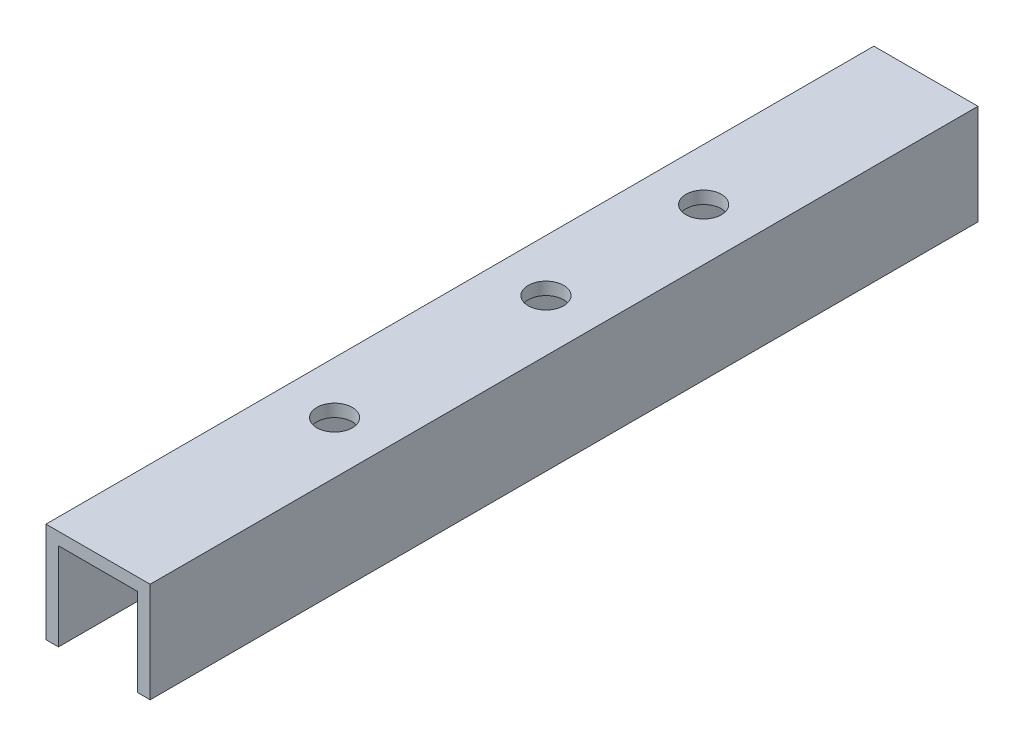
ISO-10303-21;
HEADER;
FILE_DESCRIPTION(('STEP AP214'),'2;1');
FILE_NAME('part.step','',(''),(''),'','','');
FILE_SCHEMA(('AUTOMOTIVE_DESIGN { 1 0 10303 214 1 1 1 1 }'));
ENDSEC;
DATA;
#1=APPLICATION_CONTEXT('core data for automotive mechanical design processes');
#2=APPLICATION_PROTOCOL_DEFINITION('international standard','automotive_design',2000,#1);
#3=PRODUCT_CONTEXT('',#1,'mechanical');
#4=PRODUCT('Part','Part','',(#3));
#5=PRODUCT_RELATED_PRODUCT_CATEGORY('part','',(#4));
#6=PRODUCT_DEFINITION_FORMATION('','',#4);
#7=PRODUCT_DEFINITION_CONTEXT('part definition',#1,'design');
#8=PRODUCT_DEFINITION('design','',#6,#7);
#9=PRODUCT_DEFINITION_SHAPE('','',#8);
#10=(LENGTH_UNIT() NAMED_UNIT(*) SI_UNIT(.MILLI.,.METRE.));
#11=(NAMED_UNIT(*) PLANE_ANGLE_UNIT() SI_UNIT($,.RADIAN.));
#12=(NAMED_UNIT(*) SI_UNIT($,.STERADIAN.) SOLID_ANGLE_UNIT());
#13=UNCERTAINTY_MEASURE_WITH_UNIT(LENGTH_MEASURE(1.E-05),#10,'distance_accuracy_value','');
#14=(GEOMETRIC_REPRESENTATION_CONTEXT(3) GLOBAL_UNCERTAINTY_ASSIGNED_CONTEXT((#13)) GLOBAL_UNIT_ASSIGNED_CONTEXT((#10,
#11,#12)) REPRESENTATION_CONTEXT('',''));
#15=CARTESIAN_POINT('',(0.,0.,0.));
#16=DIRECTION('',(0.,0.,1.));
#17=DIRECTION('',(1.,0.,0.));
#18=AXIS2_PLACEMENT_3D('',#15,#16,#17);
#19=CARTESIAN_POINT('',(-6.604,0.,-105.));
#20=DIRECTION('',(-1.,0.,0.));
#21=DIRECTION('',(0.,-1.,0.));
#22=AXIS2_PLACEMENT_3D('',#19,#20,#21);
#23=PLANE('',#22);
#24=DIRECTION('',(0.,-1.,0.));
#25=VECTOR('',#24,1.);
#26=CARTESIAN_POINT('',(-6.604,0.,0.));
#27=LINE('',#26,#25);
#28=CARTESIAN_POINT('',(-6.604,0.,0.));
#29=VERTEX_POINT('',#28);
#30=CARTESIAN_POINT('',(-6.604,-12.7,0.));
#31=VERTEX_POINT('',#30);
#32=EDGE_CURVE('E137',#29,#31,#27,.T.);
#33=ORIENTED_EDGE('',*,*,#32,.F.);
#34=DIRECTION('',(0.,0.,1.));
#35=VECTOR('',#34,1.);
#36=CARTESIAN_POINT('',(-6.604,0.,-105.));
#37=LINE('',#36,#35);
#38=CARTESIAN_POINT('',(-6.604,0.,-105.));
#39=VERTEX_POINT('',#38);
#40=EDGE_CURVE('E11',#39,#29,#37,.T.);
#41=ORIENTED_EDGE('',*,*,#40,.F.);
#42=DIRECTION('',(0.,-1.,0.));
#43=VECTOR('',#42,1.);
#44=CARTESIAN_POINT('',(-6.604,0.,-105.));
#45=LINE('',#44,#43);
#46=CARTESIAN_POINT('',(-6.604,-12.7,-105.));
#47=VERTEX_POINT('',#46);
#48=EDGE_CURVE('E158',#39,#47,#45,.T.);
#49=ORIENTED_EDGE('',*,*,#48,.T.);
#50=DIRECTION('',(0.,0.,1.));
#51=VECTOR('',#50,1.);
#52=CARTESIAN_POINT('',(-6.604,-12.7,-105.));
#53=LINE('',#52,#51);
#54=EDGE_CURVE('E94',#47,#31,#53,.T.);
#55=ORIENTED_EDGE('',*,*,#54,.T.);
#56=EDGE_LOOP('',(#33,#41,#49,#55));
#57=FACE_BOUND('',#56,.T.);
#58=ADVANCED_FACE('F37',(#57),#23,.T.);
#59=CARTESIAN_POINT('',(-6.604,0.,-105.));
#60=DIRECTION('',(0.,1.,0.));
#61=DIRECTION('',(-1.,0.,0.));
#62=AXIS2_PLACEMENT_3D('',#59,#60,#61);
#63=PLANE('',#62);
#64=CARTESIAN_POINT('',(0.,0.,-30.));
#65=DIRECTION('',(0.,1.,0.));
#66=DIRECTION('',(0.,0.,1.));
#67=AXIS2_PLACEMENT_3D('',#64,#65,#66);
#68=CIRCLE('',#67,2.24999999999999);
#69=CARTESIAN_POINT('',(0.,0.,-27.75));
#70=VERTEX_POINT('',#69);
#71=EDGE_CURVE('E228',#70,#70,#68,.T.);
#72=ORIENTED_EDGE('',*,*,#71,.F.);
#73=EDGE_LOOP('',(#72));
#74=FACE_BOUND('',#73,.T.);
#75=CARTESIAN_POINT('',(0.,0.,-76.807786));
#76=DIRECTION('',(0.,1.,0.));
#77=DIRECTION('',(0.,0.,1.));
#78=AXIS2_PLACEMENT_3D('',#75,#76,#77);
#79=CIRCLE('',#78,2.24999999999999);
#80=CARTESIAN_POINT('',(0.,0.,-74.557786));
#81=VERTEX_POINT('',#80);
#82=EDGE_CURVE('E232',#81,#81,#79,.T.);
#83=ORIENTED_EDGE('',*,*,#82,.F.);
#84=EDGE_LOOP('',(#83));
#85=FACE_BOUND('',#84,.T.);
#86=CARTESIAN_POINT('',(0.,0.,-56.807786));
#87=DIRECTION('',(0.,1.,0.));
#88=DIRECTION('',(0.,0.,1.));
#89=AXIS2_PLACEMENT_3D('',#86,#87,#88);
#90=CIRCLE('',#89,2.24999999999999);
#91=CARTESIAN_POINT('',(0.,0.,-54.557786));
#92=VERTEX_POINT('',#91);
#93=EDGE_CURVE('E237',#92,#92,#90,.T.);
#94=ORIENTED_EDGE('',*,*,#93,.F.);
#95=EDGE_LOOP('',(#94));
#96=FACE_BOUND('',#95,.T.);
#97=DIRECTION('',(-1.,0.,0.));
#98=VECTOR('',#97,1.);
#99=CARTESIAN_POINT('',(-6.604,0.,0.));
#100=LINE('',#99,#98);
#101=CARTESIAN_POINT('',(6.604,0.,0.));
#102=VERTEX_POINT('',#101);
#103=EDGE_CURVE('E156',#102,#29,#100,.T.);
#104=ORIENTED_EDGE('',*,*,#103,.F.);
#105=DIRECTION('',(0.,0.,1.));
#106=VECTOR('',#105,1.);
#107=CARTESIAN_POINT('',(6.604,0.,-105.));
#108=LINE('',#107,#106);
#109=CARTESIAN_POINT('',(6.604,0.,-105.));
#110=VERTEX_POINT('',#109);
#111=EDGE_CURVE('E47',#110,#102,#108,.T.);
#112=ORIENTED_EDGE('',*,*,#111,.F.);
#113=DIRECTION('',(-1.,0.,0.));
#114=VECTOR('',#113,1.);
#115=CARTESIAN_POINT('',(-6.604,0.,-105.));
#116=LINE('',#115,#114);
#117=EDGE_CURVE('E127',#110,#39,#116,.T.);
#118=ORIENTED_EDGE('',*,*,#117,.T.);
#119=ORIENTED_EDGE('',*,*,#40,.T.);
#120=EDGE_LOOP('',(#104,#112,#118,#119));
#121=FACE_BOUND('',#120,.T.);
#122=ADVANCED_FACE('F175',(#74,#85,#96,#121),#63,.T.);
#123=CARTESIAN_POINT('',(6.604,0.,-105.));
#124=DIRECTION('',(1.,0.,0.));
#125=DIRECTION('',(0.,1.,0.));
#126=AXIS2_PLACEMENT_3D('',#123,#124,#125);
#127=PLANE('',#126);
#128=DIRECTION('',(0.,1.,0.));
#129=VECTOR('',#128,1.);
#130=CARTESIAN_POINT('',(6.604,0.,0.));
#131=LINE('',#130,#129);
#132=CARTESIAN_POINT('',(6.604,-12.7,0.));
#133=VERTEX_POINT('',#132);
#134=EDGE_CURVE('E113',#133,#102,#131,.T.);
#135=ORIENTED_EDGE('',*,*,#134,.F.);
#136=DIRECTION('',(0.,0.,1.));
#137=VECTOR('',#136,1.);
#138=CARTESIAN_POINT('',(6.604,-12.7,-105.));
#139=LINE('',#138,#137);
#140=CARTESIAN_POINT('',(6.604,-12.7,-105.));
#141=VERTEX_POINT('',#140);
#142=EDGE_CURVE('E108',#141,#133,#139,.T.);
#143=ORIENTED_EDGE('',*,*,#142,.F.);
#144=DIRECTION('',(0.,1.,0.));
#145=VECTOR('',#144,1.);
#146=CARTESIAN_POINT('',(6.604,0.,-105.));
#147=LINE('',#146,#145);
#148=EDGE_CURVE('E111',#141,#110,#147,.T.);
#149=ORIENTED_EDGE('',*,*,#148,.T.);
#150=ORIENTED_EDGE('',*,*,#111,.T.);
#151=EDGE_LOOP('',(#135,#143,#149,#150));
#152=FACE_BOUND('',#151,.T.);
#153=ADVANCED_FACE('F110',(#152),#127,.T.);
#154=CARTESIAN_POINT('',(6.604,-12.7,-105.));
#155=DIRECTION('',(0.,-1.,0.));
#156=DIRECTION('',(0.,0.,-1.));
#157=AXIS2_PLACEMENT_3D('',#154,#155,#156);
#158=PLANE('',#157);
#159=DIRECTION('',(1.,0.,0.));
#160=VECTOR('',#159,1.);
#161=CARTESIAN_POINT('',(6.604,-12.7,0.));
#162=LINE('',#161,#160);
#163=CARTESIAN_POINT('',(5.0165,-12.7,0.));
#164=VERTEX_POINT('',#163);
#165=EDGE_CURVE('E153',#164,#133,#162,.T.);
#166=ORIENTED_EDGE('',*,*,#165,.F.);
#167=DIRECTION('',(0.,0.,1.));
#168=VECTOR('',#167,1.);
#169=CARTESIAN_POINT('',(5.0165,-12.7,-105.));
#170=LINE('',#169,#168);
#171=CARTESIAN_POINT('',(5.0165,-12.7,-105.));
#172=VERTEX_POINT('',#171);
#173=EDGE_CURVE('E119',#172,#164,#170,.T.);
#174=ORIENTED_EDGE('',*,*,#173,.F.);
#175=DIRECTION('',(1.,0.,0.));
#176=VECTOR('',#175,1.);
#177=CARTESIAN_POINT('',(6.604,-12.7,-105.));
#178=LINE('',#177,#176);
#179=EDGE_CURVE('E125',#172,#141,#178,.T.);
#180=ORIENTED_EDGE('',*,*,#179,.T.);
#181=ORIENTED_EDGE('',*,*,#142,.T.);
#182=EDGE_LOOP('',(#166,#174,#180,#181));
#183=FACE_BOUND('',#182,.T.);
#184=ADVANCED_FACE('F129',(#183),#158,.T.);
#185=CARTESIAN_POINT('',(5.0165,-12.7,-105.));
#186=DIRECTION('',(-1.,0.,0.));
#187=DIRECTION('',(0.,0.,1.));
#188=AXIS2_PLACEMENT_3D('',#185,#186,#187);
#189=PLANE('',#188);
#190=DIRECTION('',(0.,-1.,0.));
#191=VECTOR('',#190,1.);
#192=CARTESIAN_POINT('',(5.0165,-12.7,0.));
#193=LINE('',#192,#191);
#194=CARTESIAN_POINT('',(5.0165,-1.5875,0.));
#195=VERTEX_POINT('',#194);
#196=EDGE_CURVE('E150',#195,#164,#193,.T.);
#197=ORIENTED_EDGE('',*,*,#196,.F.);
#198=DIRECTION('',(0.,0.,1.));
#199=VECTOR('',#198,1.);
#200=CARTESIAN_POINT('',(5.0165,-1.5875,-105.));
#201=LINE('',#200,#199);
#202=CARTESIAN_POINT('',(5.0165,-1.5875,-105.));
#203=VERTEX_POINT('',#202);
#204=EDGE_CURVE('E164',#203,#195,#201,.T.);
#205=ORIENTED_EDGE('',*,*,#204,.F.);
#206=DIRECTION('',(0.,-1.,0.));
#207=VECTOR('',#206,1.);
#208=CARTESIAN_POINT('',(5.0165,-12.7,-105.));
#209=LINE('',#208,#207);
#210=EDGE_CURVE('E130',#203,#172,#209,.T.);
#211=ORIENTED_EDGE('',*,*,#210,.T.);
#212=ORIENTED_EDGE('',*,*,#173,.T.);
#213=EDGE_LOOP('',(#197,#205,#211,#212));
#214=FACE_BOUND('',#213,.T.);
#215=ADVANCED_FACE('F191',(#214),#189,.T.);
#216=CARTESIAN_POINT('',(5.0165,-1.5875,-105.));
#217=DIRECTION('',(0.,-1.,0.));
#218=DIRECTION('',(1.,0.,0.));
#219=AXIS2_PLACEMENT_3D('',#216,#217,#218);
#220=PLANE('',#219);
#221=CARTESIAN_POINT('',(0.,-1.5875,-30.));
#222=DIRECTION('',(0.,-1.,0.));
#223=DIRECTION('',(1.,0.,0.));
#224=AXIS2_PLACEMENT_3D('',#221,#222,#223);
#225=CIRCLE('',#224,2.24999999999997);
#226=CARTESIAN_POINT('',(2.24999999999997,-1.5875,-30.));
#227=VERTEX_POINT('',#226);
#228=EDGE_CURVE('E226',#227,#227,#225,.T.);
#229=ORIENTED_EDGE('',*,*,#228,.F.);
#230=EDGE_LOOP('',(#229));
#231=FACE_BOUND('',#230,.T.);
#232=CARTESIAN_POINT('',(0.,-1.5875,-76.807786));
#233=DIRECTION('',(0.,-1.,0.));
#234=DIRECTION('',(1.,0.,0.));
#235=AXIS2_PLACEMENT_3D('',#232,#233,#234);
#236=CIRCLE('',#235,2.24999999999997);
#237=CARTESIAN_POINT('',(2.24999999999997,-1.5875,-76.807786));
#238=VERTEX_POINT('',#237);
#239=EDGE_CURVE('E40',#238,#238,#236,.T.);
#240=ORIENTED_EDGE('',*,*,#239,.F.);
#241=EDGE_LOOP('',(#240));
#242=FACE_BOUND('',#241,.T.);
#243=CARTESIAN_POINT('',(0.,-1.5875,-56.807786));
#244=DIRECTION('',(0.,-1.,0.));
#245=DIRECTION('',(1.,0.,0.));
#246=AXIS2_PLACEMENT_3D('',#243,#244,#245);
#247=CIRCLE('',#246,2.24999999999997);
#248=CARTESIAN_POINT('',(2.24999999999997,-1.5875,-56.807786));
#249=VERTEX_POINT('',#248);
#250=EDGE_CURVE('E141',#249,#249,#247,.T.);
#251=ORIENTED_EDGE('',*,*,#250,.F.);
#252=EDGE_LOOP('',(#251));
#253=FACE_BOUND('',#252,.T.);
#254=DIRECTION('',(1.,0.,0.));
#255=VECTOR('',#254,1.);
#256=CARTESIAN_POINT('',(5.0165,-1.5875,0.));
#257=LINE('',#256,#255);
#258=CARTESIAN_POINT('',(-5.0165,-1.5875,0.));
#259=VERTEX_POINT('',#258);
#260=EDGE_CURVE('E147',#259,#195,#257,.T.);
#261=ORIENTED_EDGE('',*,*,#260,.F.);
#262=DIRECTION('',(0.,0.,1.));
#263=VECTOR('',#262,1.);
#264=CARTESIAN_POINT('',(-5.0165,-1.5875,-105.));
#265=LINE('',#264,#263);
#266=CARTESIAN_POINT('',(-5.0165,-1.5875,-105.));
#267=VERTEX_POINT('',#266);
#268=EDGE_CURVE('E167',#267,#259,#265,.T.);
#269=ORIENTED_EDGE('',*,*,#268,.F.);
#270=DIRECTION('',(1.,0.,0.));
#271=VECTOR('',#270,1.);
#272=CARTESIAN_POINT('',(5.0165,-1.5875,-105.));
#273=LINE('',#272,#271);
#274=EDGE_CURVE('E132',#267,#203,#273,.T.);
#275=ORIENTED_EDGE('',*,*,#274,.T.);
#276=ORIENTED_EDGE('',*,*,#204,.T.);
#277=EDGE_LOOP('',(#261,#269,#275,#276));
#278=FACE_BOUND('',#277,.T.);
#279=ADVANCED_FACE('F194',(#231,#242,#253,#278),#220,.T.);
#280=CARTESIAN_POINT('',(-5.0165,-12.7,-105.));
#281=DIRECTION('',(1.,0.,0.));
#282=DIRECTION('',(0.,1.,0.));
#283=AXIS2_PLACEMENT_3D('',#280,#281,#282);
#284=PLANE('',#283);
#285=DIRECTION('',(0.,1.,0.));
#286=VECTOR('',#285,1.);
#287=CARTESIAN_POINT('',(-5.0165,-12.7,0.));
#288=LINE('',#287,#286);
#289=CARTESIAN_POINT('',(-5.0165,-12.7,0.));
#290=VERTEX_POINT('',#289);
#291=EDGE_CURVE('E144',#290,#259,#288,.T.);
#292=ORIENTED_EDGE('',*,*,#291,.F.);
#293=DIRECTION('',(0.,0.,1.));
#294=VECTOR('',#293,1.);
#295=CARTESIAN_POINT('',(-5.0165,-12.7,-105.));
#296=LINE('',#295,#294);
#297=CARTESIAN_POINT('',(-5.0165,-12.7,-105.));
#298=VERTEX_POINT('',#297);
#299=EDGE_CURVE('E170',#298,#290,#296,.T.);
#300=ORIENTED_EDGE('',*,*,#299,.F.);
#301=DIRECTION('',(0.,1.,0.));
#302=VECTOR('',#301,1.);
#303=CARTESIAN_POINT('',(-5.0165,-12.7,-105.));
#304=LINE('',#303,#302);
#305=EDGE_CURVE('E245',#298,#267,#304,.T.);
#306=ORIENTED_EDGE('',*,*,#305,.T.);
#307=ORIENTED_EDGE('',*,*,#268,.T.);
#308=EDGE_LOOP('',(#292,#300,#306,#307));
#309=FACE_BOUND('',#308,.T.);
#310=ADVANCED_FACE('F198',(#309),#284,.T.);
#311=CARTESIAN_POINT('',(-6.604,-12.7,-105.));
#312=DIRECTION('',(0.,-1.,0.));
#313=DIRECTION('',(0.,0.,-1.));
#314=AXIS2_PLACEMENT_3D('',#311,#312,#313);
#315=PLANE('',#314);
#316=DIRECTION('',(1.,0.,0.));
#317=VECTOR('',#316,1.);
#318=CARTESIAN_POINT('',(-6.604,-12.7,0.));
#319=LINE('',#318,#317);
#320=EDGE_CURVE('E140',#31,#290,#319,.T.);
#321=ORIENTED_EDGE('',*,*,#320,.F.);
#322=ORIENTED_EDGE('',*,*,#54,.F.);
#323=DIRECTION('',(1.,0.,0.));
#324=VECTOR('',#323,1.);
#325=CARTESIAN_POINT('',(-6.604,-12.7,-105.));
#326=LINE('',#325,#324);
#327=EDGE_CURVE('E243',#47,#298,#326,.T.);
#328=ORIENTED_EDGE('',*,*,#327,.T.);
#329=ORIENTED_EDGE('',*,*,#299,.T.);
#330=EDGE_LOOP('',(#321,#322,#328,#329));
#331=FACE_BOUND('',#330,.T.);
#332=ADVANCED_FACE('F171',(#331),#315,.T.);
#333=CARTESIAN_POINT('',(0.,0.,-105.));
#334=DIRECTION('',(0.,0.,1.));
#335=DIRECTION('',(1.,0.,0.));
#336=AXIS2_PLACEMENT_3D('',#333,#334,#335);
#337=PLANE('',#336);
#338=ORIENTED_EDGE('',*,*,#48,.F.);
#339=ORIENTED_EDGE('',*,*,#117,.F.);
#340=ORIENTED_EDGE('',*,*,#148,.F.);
#341=ORIENTED_EDGE('',*,*,#179,.F.);
#342=ORIENTED_EDGE('',*,*,#210,.F.);
#343=ORIENTED_EDGE('',*,*,#274,.F.);
#344=ORIENTED_EDGE('',*,*,#305,.F.);
#345=ORIENTED_EDGE('',*,*,#327,.F.);
#346=EDGE_LOOP('',(#338,#339,#340,#341,#342,#343,#344,#345));
#347=FACE_BOUND('',#346,.T.);
#348=ADVANCED_FACE('F123',(#347),#337,.F.);
#349=CARTESIAN_POINT('',(0.,0.,0.));
#350=DIRECTION('',(0.,0.,1.));
#351=DIRECTION('',(1.,0.,0.));
#352=AXIS2_PLACEMENT_3D('',#349,#350,#351);
#353=PLANE('',#352);
#354=ORIENTED_EDGE('',*,*,#32,.T.);
#355=ORIENTED_EDGE('',*,*,#320,.T.);
#356=ORIENTED_EDGE('',*,*,#291,.T.);
#357=ORIENTED_EDGE('',*,*,#260,.T.);
#358=ORIENTED_EDGE('',*,*,#196,.T.);
#359=ORIENTED_EDGE('',*,*,#165,.T.);
#360=ORIENTED_EDGE('',*,*,#134,.T.);
#361=ORIENTED_EDGE('',*,*,#103,.T.);
#362=EDGE_LOOP('',(#354,#355,#356,#357,#358,#359,#360,#361));
#363=FACE_BOUND('',#362,.T.);
#364=ADVANCED_FACE('F174',(#363),#353,.T.);
#365=CARTESIAN_POINT('',(0.,0.,-56.807786));
#366=DIRECTION('',(0.,1.,0.));
#367=DIRECTION('',(0.,0.,1.));
#368=AXIS2_PLACEMENT_3D('',#365,#366,#367);
#369=CYLINDRICAL_SURFACE('',#368,2.24999999999997);
#370=ORIENTED_EDGE('',*,*,#250,.T.);
#371=EDGE_LOOP('',(#370));
#372=FACE_BOUND('',#371,.T.);
#373=ORIENTED_EDGE('',*,*,#93,.T.);
#374=EDGE_LOOP('',(#373));
#375=FACE_BOUND('',#374,.T.);
#376=ADVANCED_FACE('F209',(#372,#375),#369,.F.);
#377=CARTESIAN_POINT('',(0.,0.,-76.807786));
#378=DIRECTION('',(0.,1.,0.));
#379=DIRECTION('',(0.,0.,1.));
#380=AXIS2_PLACEMENT_3D('',#377,#378,#379);
#381=CYLINDRICAL_SURFACE('',#380,2.24999999999997);
#382=ORIENTED_EDGE('',*,*,#239,.T.);
#383=EDGE_LOOP('',(#382));
#384=FACE_BOUND('',#383,.T.);
#385=ORIENTED_EDGE('',*,*,#82,.T.);
#386=EDGE_LOOP('',(#385));
#387=FACE_BOUND('',#386,.T.);
#388=ADVANCED_FACE('F213',(#384,#387),#381,.F.);
#389=CARTESIAN_POINT('',(0.,0.,-30.));
#390=DIRECTION('',(0.,1.,0.));
#391=DIRECTION('',(0.,0.,1.));
#392=AXIS2_PLACEMENT_3D('',#389,#390,#391);
#393=CYLINDRICAL_SURFACE('',#392,2.24999999999997);
#394=ORIENTED_EDGE('',*,*,#228,.T.);
#395=EDGE_LOOP('',(#394));
#396=FACE_BOUND('',#395,.T.);
#397=ORIENTED_EDGE('',*,*,#71,.T.);
#398=EDGE_LOOP('',(#397));
#399=FACE_BOUND('',#398,.T.);
#400=ADVANCED_FACE('F217',(#396,#399),#393,.F.);
#401=CLOSED_SHELL('',(#58,#122,#153,#184,#215,#279,#310,#332,#348,#364,#376,#388,#400));
#402=MANIFOLD_SOLID_BREP('B2',#401);
#403=ADVANCED_BREP_SHAPE_REPRESENTATION('',(#18,#402),#14);
#404=SHAPE_DEFINITION_REPRESENTATION(#9,#403);
ENDSEC;
END-ISO-10303-21;
